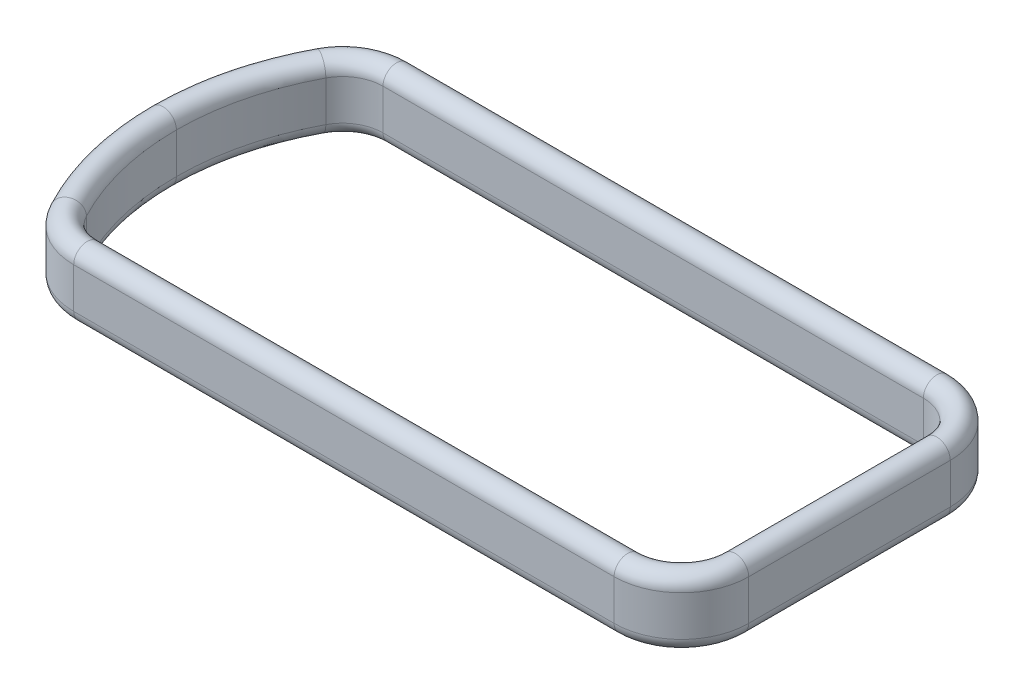
ISO-10303-21;
HEADER;
FILE_DESCRIPTION(('STEP AP214'),'2;1');
FILE_NAME('part.step','',(''),(''),'','','');
FILE_SCHEMA(('AUTOMOTIVE_DESIGN { 1 0 10303 214 1 1 1 1 }'));
ENDSEC;
DATA;
#1=APPLICATION_CONTEXT('core data for automotive mechanical design processes');
#2=APPLICATION_PROTOCOL_DEFINITION('international standard','automotive_design',2000,#1);
#3=PRODUCT_CONTEXT('',#1,'mechanical');
#4=PRODUCT('Part','Part','',(#3));
#5=PRODUCT_RELATED_PRODUCT_CATEGORY('part','',(#4));
#6=PRODUCT_DEFINITION_FORMATION('','',#4);
#7=PRODUCT_DEFINITION_CONTEXT('part definition',#1,'design');
#8=PRODUCT_DEFINITION('design','',#6,#7);
#9=PRODUCT_DEFINITION_SHAPE('','',#8);
#10=(LENGTH_UNIT() NAMED_UNIT(*) SI_UNIT(.MILLI.,.METRE.));
#11=(NAMED_UNIT(*) PLANE_ANGLE_UNIT() SI_UNIT($,.RADIAN.));
#12=(NAMED_UNIT(*) SI_UNIT($,.STERADIAN.) SOLID_ANGLE_UNIT());
#13=UNCERTAINTY_MEASURE_WITH_UNIT(LENGTH_MEASURE(1.E-05),#10,'distance_accuracy_value','');
#14=(GEOMETRIC_REPRESENTATION_CONTEXT(3) GLOBAL_UNCERTAINTY_ASSIGNED_CONTEXT((#13)) GLOBAL_UNIT_ASSIGNED_CONTEXT((#10,
#11,#12)) REPRESENTATION_CONTEXT('',''));
#15=CARTESIAN_POINT('',(0.,0.,0.));
#16=DIRECTION('',(0.,0.,1.));
#17=DIRECTION('',(1.,0.,0.));
#18=AXIS2_PLACEMENT_3D('',#15,#16,#17);
#19=CARTESIAN_POINT('',(-29.6489581699562,-15.,0.));
#20=DIRECTION('',(0.,1.,0.));
#21=DIRECTION('',(0.,0.,1.));
#22=AXIS2_PLACEMENT_3D('',#19,#20,#21);
#23=TOROIDAL_SURFACE('',#22,100.,5.00000000000006);
#24=CARTESIAN_POINT('',(-29.6489581699562,-15.,0.));
#25=DIRECTION('',(0.,1.,0.));
#26=DIRECTION('',(-0.883776045751095,0.,-0.467910141968048));
#27=AXIS2_PLACEMENT_3D('',#24,#25,#26);
#28=CIRCLE('',#27,105.);
#29=CARTESIAN_POINT('',(-122.445442973821,-15.,-49.1305649066451));
#30=VERTEX_POINT('',#29);
#31=CARTESIAN_POINT('',(-134.648958169956,-15.,0.));
#32=VERTEX_POINT('',#31);
#33=EDGE_CURVE('E11',#30,#32,#28,.T.);
#34=ORIENTED_EDGE('',*,*,#33,.F.);
#35=CARTESIAN_POINT('',(-118.026562745066,-15.,-46.7910141968048));
#36=DIRECTION('',(-0.467910141968049,0.,0.883776045751094));
#37=DIRECTION('',(0.883776045751094,0.,0.467910141968049));
#38=AXIS2_PLACEMENT_3D('',#35,#36,#37);
#39=CIRCLE('',#38,5.00000000000006);
#40=CARTESIAN_POINT('',(-113.60768251631,-15.,-44.4514634869646));
#41=VERTEX_POINT('',#40);
#42=EDGE_CURVE('E38',#30,#41,#39,.T.);
#43=ORIENTED_EDGE('',*,*,#42,.T.);
#44=CARTESIAN_POINT('',(-29.6489581699562,-15.,0.));
#45=DIRECTION('',(0.,1.,0.));
#46=DIRECTION('',(-0.883776045751095,0.,-0.467910141968048));
#47=AXIS2_PLACEMENT_3D('',#44,#45,#46);
#48=CIRCLE('',#47,95.);
#49=CARTESIAN_POINT('',(-124.648958169956,-15.,0.));
#50=VERTEX_POINT('',#49);
#51=EDGE_CURVE('E183',#41,#50,#48,.T.);
#52=ORIENTED_EDGE('',*,*,#51,.T.);
#53=CARTESIAN_POINT('',(-129.648958169956,-15.,0.));
#54=DIRECTION('',(0.,0.,1.));
#55=DIRECTION('',(1.,0.,0.));
#56=AXIS2_PLACEMENT_3D('',#53,#54,#55);
#57=CIRCLE('',#56,5.00000000000006);
#58=EDGE_CURVE('E186',#32,#50,#57,.T.);
#59=ORIENTED_EDGE('',*,*,#58,.F.);
#60=EDGE_LOOP('',(#34,#43,#52,#59));
#61=FACE_BOUND('',#60,.T.);
#62=ADVANCED_FACE('F35',(#61),#23,.T.);
#63=CARTESIAN_POINT('',(-29.6489581699562,0.,0.));
#64=DIRECTION('',(0.,1.,0.));
#65=DIRECTION('',(0.,0.,1.));
#66=AXIS2_PLACEMENT_3D('',#63,#64,#65);
#67=CYLINDRICAL_SURFACE('',#66,105.);
#68=CARTESIAN_POINT('',(-29.6489581699562,0.,0.));
#69=DIRECTION('',(0.,1.,0.));
#70=DIRECTION('',(-0.883776045751095,0.,-0.467910141968048));
#71=AXIS2_PLACEMENT_3D('',#68,#69,#70);
#72=CIRCLE('',#71,105.);
#73=CARTESIAN_POINT('',(-122.445442973821,0.,-49.1305649066451));
#74=VERTEX_POINT('',#73);
#75=CARTESIAN_POINT('',(-134.648958169956,0.,0.));
#76=VERTEX_POINT('',#75);
#77=EDGE_CURVE('E43',#74,#76,#72,.T.);
#78=ORIENTED_EDGE('',*,*,#77,.F.);
#79=DIRECTION('',(0.,-1.,0.));
#80=VECTOR('',#79,1.);
#81=CARTESIAN_POINT('',(-122.445442973821,0.,-49.130564906645));
#82=LINE('',#81,#80);
#83=EDGE_CURVE('E336',#74,#30,#82,.T.);
#84=ORIENTED_EDGE('',*,*,#83,.T.);
#85=ORIENTED_EDGE('',*,*,#33,.T.);
#86=DIRECTION('',(0.,-1.,0.));
#87=VECTOR('',#86,1.);
#88=CARTESIAN_POINT('',(-134.648958169956,0.,0.));
#89=LINE('',#88,#87);
#90=EDGE_CURVE('E211',#76,#32,#89,.T.);
#91=ORIENTED_EDGE('',*,*,#90,.F.);
#92=EDGE_LOOP('',(#78,#84,#85,#91));
#93=FACE_BOUND('',#92,.T.);
#94=ADVANCED_FACE('F458',(#93),#67,.T.);
#95=CARTESIAN_POINT('',(-29.6489581699562,0.,0.));
#96=DIRECTION('',(0.,1.,0.));
#97=DIRECTION('',(0.,0.,1.));
#98=AXIS2_PLACEMENT_3D('',#95,#96,#97);
#99=TOROIDAL_SURFACE('',#98,100.,5.00000000000001);
#100=CARTESIAN_POINT('',(-29.6489581699562,0.,0.));
#101=DIRECTION('',(0.,1.,0.));
#102=DIRECTION('',(-0.883776045751095,0.,-0.467910141968048));
#103=AXIS2_PLACEMENT_3D('',#100,#101,#102);
#104=CIRCLE('',#103,95.);
#105=CARTESIAN_POINT('',(-113.60768251631,0.,-44.4514634869646));
#106=VERTEX_POINT('',#105);
#107=CARTESIAN_POINT('',(-124.648958169956,0.,0.));
#108=VERTEX_POINT('',#107);
#109=EDGE_CURVE('E192',#106,#108,#104,.T.);
#110=ORIENTED_EDGE('',*,*,#109,.F.);
#111=CARTESIAN_POINT('',(-118.026562745066,0.,-46.7910141968048));
#112=DIRECTION('',(-0.467910141968049,0.,0.883776045751094));
#113=DIRECTION('',(0.883776045751094,0.,0.467910141968049));
#114=AXIS2_PLACEMENT_3D('',#111,#112,#113);
#115=CIRCLE('',#114,5.00000000000001);
#116=EDGE_CURVE('E292',#106,#74,#115,.T.);
#117=ORIENTED_EDGE('',*,*,#116,.T.);
#118=ORIENTED_EDGE('',*,*,#77,.T.);
#119=CARTESIAN_POINT('',(-129.648958169956,0.,0.));
#120=DIRECTION('',(0.,0.,1.));
#121=DIRECTION('',(1.,0.,0.));
#122=AXIS2_PLACEMENT_3D('',#119,#120,#121);
#123=CIRCLE('',#122,5.00000000000001);
#124=EDGE_CURVE('E215',#108,#76,#123,.T.);
#125=ORIENTED_EDGE('',*,*,#124,.F.);
#126=EDGE_LOOP('',(#110,#117,#118,#125));
#127=FACE_BOUND('',#126,.T.);
#128=ADVANCED_FACE('F462',(#127),#99,.T.);
#129=CARTESIAN_POINT('',(-100.351041830044,-15.,-37.4328113574438));
#130=DIRECTION('',(0.,1.,0.));
#131=DIRECTION('',(0.,0.,1.));
#132=AXIS2_PLACEMENT_3D('',#129,#130,#131);
#133=TOROIDAL_SURFACE('',#132,20.0000000000001,5.00000000000006);
#134=ORIENTED_EDGE('',*,*,#42,.F.);
#135=CARTESIAN_POINT('',(-100.351041830044,-15.,-37.4328113574438));
#136=DIRECTION('',(0.,1.,0.));
#137=DIRECTION('',(0.,0.,-1.));
#138=AXIS2_PLACEMENT_3D('',#135,#136,#137);
#139=CIRCLE('',#138,25.0000000000002);
#140=CARTESIAN_POINT('',(-100.351041830044,-15.,-62.432811357444));
#141=VERTEX_POINT('',#140);
#142=EDGE_CURVE('E104',#141,#30,#139,.T.);
#143=ORIENTED_EDGE('',*,*,#142,.F.);
#144=CARTESIAN_POINT('',(-100.351041830044,-15.,-57.4328113574439));
#145=DIRECTION('',(-1.,0.,0.));
#146=DIRECTION('',(0.,0.,1.));
#147=AXIS2_PLACEMENT_3D('',#144,#145,#146);
#148=CIRCLE('',#147,5.00000000000006);
#149=CARTESIAN_POINT('',(-100.351041830044,-15.,-52.4328113574438));
#150=VERTEX_POINT('',#149);
#151=EDGE_CURVE('E295',#141,#150,#148,.T.);
#152=ORIENTED_EDGE('',*,*,#151,.T.);
#153=CARTESIAN_POINT('',(-100.351041830044,-15.,-37.4328113574438));
#154=DIRECTION('',(0.,1.,0.));
#155=DIRECTION('',(0.,0.,-1.));
#156=AXIS2_PLACEMENT_3D('',#153,#154,#155);
#157=CIRCLE('',#156,15.);
#158=EDGE_CURVE('E290',#150,#41,#157,.T.);
#159=ORIENTED_EDGE('',*,*,#158,.T.);
#160=EDGE_LOOP('',(#134,#143,#152,#159));
#161=FACE_BOUND('',#160,.T.);
#162=ADVANCED_FACE('F382',(#161),#133,.T.);
#163=CARTESIAN_POINT('',(-100.351041830044,0.,-37.4328113574438));
#164=DIRECTION('',(0.,1.,0.));
#165=DIRECTION('',(0.,0.,1.));
#166=AXIS2_PLACEMENT_3D('',#163,#164,#165);
#167=CYLINDRICAL_SURFACE('',#166,25.0000000000001);
#168=ORIENTED_EDGE('',*,*,#142,.T.);
#169=ORIENTED_EDGE('',*,*,#83,.F.);
#170=CARTESIAN_POINT('',(-100.351041830044,0.,-37.4328113574438));
#171=DIRECTION('',(0.,1.,0.));
#172=DIRECTION('',(0.,0.,-1.));
#173=AXIS2_PLACEMENT_3D('',#170,#171,#172);
#174=CIRCLE('',#173,25.);
#175=CARTESIAN_POINT('',(-100.351041830044,0.,-62.4328113574438));
#176=VERTEX_POINT('',#175);
#177=EDGE_CURVE('E113',#176,#74,#174,.T.);
#178=ORIENTED_EDGE('',*,*,#177,.F.);
#179=DIRECTION('',(0.,-1.,0.));
#180=VECTOR('',#179,1.);
#181=CARTESIAN_POINT('',(-100.351041830044,0.,-62.4328113574438));
#182=LINE('',#181,#180);
#183=EDGE_CURVE('E332',#176,#141,#182,.T.);
#184=ORIENTED_EDGE('',*,*,#183,.T.);
#185=EDGE_LOOP('',(#168,#169,#178,#184));
#186=FACE_BOUND('',#185,.T.);
#187=ADVANCED_FACE('F459',(#186),#167,.T.);
#188=CARTESIAN_POINT('',(-100.351041830044,0.,-37.4328113574438));
#189=DIRECTION('',(0.,1.,0.));
#190=DIRECTION('',(0.,0.,1.));
#191=AXIS2_PLACEMENT_3D('',#188,#189,#190);
#192=TOROIDAL_SURFACE('',#191,20.,5.00000000000001);
#193=ORIENTED_EDGE('',*,*,#177,.T.);
#194=ORIENTED_EDGE('',*,*,#116,.F.);
#195=CARTESIAN_POINT('',(-100.351041830044,0.,-37.4328113574438));
#196=DIRECTION('',(0.,1.,0.));
#197=DIRECTION('',(0.,0.,-1.));
#198=AXIS2_PLACEMENT_3D('',#195,#196,#197);
#199=CIRCLE('',#198,15.);
#200=CARTESIAN_POINT('',(-100.351041830044,0.,-52.4328113574438));
#201=VERTEX_POINT('',#200);
#202=EDGE_CURVE('E121',#201,#106,#199,.T.);
#203=ORIENTED_EDGE('',*,*,#202,.F.);
#204=CARTESIAN_POINT('',(-100.351041830044,0.,-57.4328113574438));
#205=DIRECTION('',(-1.,0.,0.));
#206=DIRECTION('',(0.,0.,1.));
#207=AXIS2_PLACEMENT_3D('',#204,#205,#206);
#208=CIRCLE('',#207,5.00000000000001);
#209=EDGE_CURVE('E284',#201,#176,#208,.T.);
#210=ORIENTED_EDGE('',*,*,#209,.T.);
#211=EDGE_LOOP('',(#193,#194,#203,#210));
#212=FACE_BOUND('',#211,.T.);
#213=ADVANCED_FACE('F460',(#212),#192,.T.);
#214=CARTESIAN_POINT('',(-100.351041830044,0.,-37.4328113574438));
#215=DIRECTION('',(0.,1.,0.));
#216=DIRECTION('',(0.,0.,1.));
#217=AXIS2_PLACEMENT_3D('',#214,#215,#216);
#218=CYLINDRICAL_SURFACE('',#217,15.);
#219=ORIENTED_EDGE('',*,*,#202,.T.);
#220=DIRECTION('',(0.,1.,0.));
#221=VECTOR('',#220,1.);
#222=CARTESIAN_POINT('',(-113.60768251631,0.,-44.4514634869645));
#223=LINE('',#222,#221);
#224=EDGE_CURVE('E288',#41,#106,#223,.T.);
#225=ORIENTED_EDGE('',*,*,#224,.F.);
#226=ORIENTED_EDGE('',*,*,#158,.F.);
#227=DIRECTION('',(0.,1.,0.));
#228=VECTOR('',#227,1.);
#229=CARTESIAN_POINT('',(-100.351041830044,0.,-52.4328113574438));
#230=LINE('',#229,#228);
#231=EDGE_CURVE('E279',#150,#201,#230,.T.);
#232=ORIENTED_EDGE('',*,*,#231,.T.);
#233=EDGE_LOOP('',(#219,#225,#226,#232));
#234=FACE_BOUND('',#233,.T.);
#235=ADVANCED_FACE('F506',(#234),#218,.F.);
#236=CARTESIAN_POINT('',(100.351041830044,-15.,-57.4328113574439));
#237=DIRECTION('',(-1.,0.,0.));
#238=DIRECTION('',(0.,0.,1.));
#239=AXIS2_PLACEMENT_3D('',#236,#237,#238);
#240=CYLINDRICAL_SURFACE('',#239,5.00000000000006);
#241=ORIENTED_EDGE('',*,*,#151,.F.);
#242=DIRECTION('',(-1.,0.,0.));
#243=VECTOR('',#242,1.);
#244=CARTESIAN_POINT('',(100.351041830044,-15.,-62.432811357444));
#245=LINE('',#244,#243);
#246=CARTESIAN_POINT('',(100.351041830044,-15.,-62.432811357444));
#247=VERTEX_POINT('',#246);
#248=EDGE_CURVE('E365',#247,#141,#245,.T.);
#249=ORIENTED_EDGE('',*,*,#248,.F.);
#250=CARTESIAN_POINT('',(100.351041830044,-15.,-57.4328113574439));
#251=DIRECTION('',(-1.,0.,0.));
#252=DIRECTION('',(0.,0.,1.));
#253=AXIS2_PLACEMENT_3D('',#250,#251,#252);
#254=CIRCLE('',#253,5.00000000000006);
#255=CARTESIAN_POINT('',(100.351041830044,-15.,-52.4328113574438));
#256=VERTEX_POINT('',#255);
#257=EDGE_CURVE('E287',#247,#256,#254,.T.);
#258=ORIENTED_EDGE('',*,*,#257,.T.);
#259=DIRECTION('',(-1.,0.,0.));
#260=VECTOR('',#259,1.);
#261=CARTESIAN_POINT('',(100.351041830044,-15.,-52.4328113574438));
#262=LINE('',#261,#260);
#263=EDGE_CURVE('E282',#256,#150,#262,.T.);
#264=ORIENTED_EDGE('',*,*,#263,.T.);
#265=EDGE_LOOP('',(#241,#249,#258,#264));
#266=FACE_BOUND('',#265,.T.);
#267=ADVANCED_FACE('F387',(#266),#240,.T.);
#268=CARTESIAN_POINT('',(100.351041830044,0.,-62.4328113574439));
#269=DIRECTION('',(0.,0.,-1.));
#270=DIRECTION('',(0.,1.,0.));
#271=AXIS2_PLACEMENT_3D('',#268,#269,#270);
#272=PLANE('',#271);
#273=ORIENTED_EDGE('',*,*,#248,.T.);
#274=ORIENTED_EDGE('',*,*,#183,.F.);
#275=DIRECTION('',(-1.,0.,0.));
#276=VECTOR('',#275,1.);
#277=CARTESIAN_POINT('',(100.351041830044,0.,-62.4328113574439));
#278=LINE('',#277,#276);
#279=CARTESIAN_POINT('',(100.351041830044,0.,-62.4328113574438));
#280=VERTEX_POINT('',#279);
#281=EDGE_CURVE('E148',#280,#176,#278,.T.);
#282=ORIENTED_EDGE('',*,*,#281,.F.);
#283=DIRECTION('',(0.,-1.,0.));
#284=VECTOR('',#283,1.);
#285=CARTESIAN_POINT('',(100.351041830044,0.,-62.4328113574439));
#286=LINE('',#285,#284);
#287=EDGE_CURVE('E329',#280,#247,#286,.T.);
#288=ORIENTED_EDGE('',*,*,#287,.T.);
#289=EDGE_LOOP('',(#273,#274,#282,#288));
#290=FACE_BOUND('',#289,.T.);
#291=ADVANCED_FACE('F522',(#290),#272,.T.);
#292=CARTESIAN_POINT('',(100.351041830044,0.,-57.4328113574439));
#293=DIRECTION('',(-1.,0.,0.));
#294=DIRECTION('',(0.,0.,1.));
#295=AXIS2_PLACEMENT_3D('',#292,#293,#294);
#296=CYLINDRICAL_SURFACE('',#295,5.00000000000001);
#297=ORIENTED_EDGE('',*,*,#281,.T.);
#298=ORIENTED_EDGE('',*,*,#209,.F.);
#299=DIRECTION('',(-1.,0.,0.));
#300=VECTOR('',#299,1.);
#301=CARTESIAN_POINT('',(100.351041830044,0.,-52.4328113574438));
#302=LINE('',#301,#300);
#303=CARTESIAN_POINT('',(100.351041830044,0.,-52.4328113574438));
#304=VERTEX_POINT('',#303);
#305=EDGE_CURVE('E154',#304,#201,#302,.T.);
#306=ORIENTED_EDGE('',*,*,#305,.F.);
#307=CARTESIAN_POINT('',(100.351041830044,0.,-57.4328113574439));
#308=DIRECTION('',(-1.,0.,0.));
#309=DIRECTION('',(0.,0.,1.));
#310=AXIS2_PLACEMENT_3D('',#307,#308,#309);
#311=CIRCLE('',#310,5.00000000000001);
#312=EDGE_CURVE('E275',#304,#280,#311,.T.);
#313=ORIENTED_EDGE('',*,*,#312,.T.);
#314=EDGE_LOOP('',(#297,#298,#306,#313));
#315=FACE_BOUND('',#314,.T.);
#316=ADVANCED_FACE('F531',(#315),#296,.T.);
#317=CARTESIAN_POINT('',(100.351041830044,0.,-52.4328113574438));
#318=DIRECTION('',(0.,0.,1.));
#319=DIRECTION('',(0.,-1.,0.));
#320=AXIS2_PLACEMENT_3D('',#317,#318,#319);
#321=PLANE('',#320);
#322=ORIENTED_EDGE('',*,*,#305,.T.);
#323=ORIENTED_EDGE('',*,*,#231,.F.);
#324=ORIENTED_EDGE('',*,*,#263,.F.);
#325=DIRECTION('',(0.,1.,0.));
#326=VECTOR('',#325,1.);
#327=CARTESIAN_POINT('',(100.351041830044,0.,-52.4328113574438));
#328=LINE('',#327,#326);
#329=EDGE_CURVE('E268',#256,#304,#328,.T.);
#330=ORIENTED_EDGE('',*,*,#329,.T.);
#331=EDGE_LOOP('',(#322,#323,#324,#330));
#332=FACE_BOUND('',#331,.T.);
#333=ADVANCED_FACE('F385',(#332),#321,.T.);
#334=CARTESIAN_POINT('',(100.351041830044,-15.,-37.4328113574438));
#335=DIRECTION('',(0.,1.,0.));
#336=DIRECTION('',(0.,0.,1.));
#337=AXIS2_PLACEMENT_3D('',#334,#335,#336);
#338=TOROIDAL_SURFACE('',#337,20.0000000000001,5.00000000000006);
#339=ORIENTED_EDGE('',*,*,#257,.F.);
#340=CARTESIAN_POINT('',(100.351041830044,-15.,-37.4328113574438));
#341=DIRECTION('',(0.,1.,0.));
#342=DIRECTION('',(1.,0.,0.));
#343=AXIS2_PLACEMENT_3D('',#340,#341,#342);
#344=CIRCLE('',#343,25.0000000000002);
#345=CARTESIAN_POINT('',(125.351041830044,-15.,-37.4328113574438));
#346=VERTEX_POINT('',#345);
#347=EDGE_CURVE('E361',#346,#247,#344,.T.);
#348=ORIENTED_EDGE('',*,*,#347,.F.);
#349=CARTESIAN_POINT('',(120.351041830044,-15.,-37.4328113574438));
#350=DIRECTION('',(0.,0.,-1.));
#351=DIRECTION('',(-1.,0.,0.));
#352=AXIS2_PLACEMENT_3D('',#349,#350,#351);
#353=CIRCLE('',#352,5.00000000000006);
#354=CARTESIAN_POINT('',(115.351041830044,-15.,-37.4328113574438));
#355=VERTEX_POINT('',#354);
#356=EDGE_CURVE('E278',#346,#355,#353,.T.);
#357=ORIENTED_EDGE('',*,*,#356,.T.);
#358=CARTESIAN_POINT('',(100.351041830044,-15.,-37.4328113574438));
#359=DIRECTION('',(0.,1.,0.));
#360=DIRECTION('',(1.,0.,0.));
#361=AXIS2_PLACEMENT_3D('',#358,#359,#360);
#362=CIRCLE('',#361,15.);
#363=EDGE_CURVE('E272',#355,#256,#362,.T.);
#364=ORIENTED_EDGE('',*,*,#363,.T.);
#365=EDGE_LOOP('',(#339,#348,#357,#364));
#366=FACE_BOUND('',#365,.T.);
#367=ADVANCED_FACE('F396',(#366),#338,.T.);
#368=CARTESIAN_POINT('',(100.351041830044,0.,-37.4328113574438));
#369=DIRECTION('',(0.,1.,0.));
#370=DIRECTION('',(0.,0.,1.));
#371=AXIS2_PLACEMENT_3D('',#368,#369,#370);
#372=CYLINDRICAL_SURFACE('',#371,25.0000000000001);
#373=ORIENTED_EDGE('',*,*,#347,.T.);
#374=ORIENTED_EDGE('',*,*,#287,.F.);
#375=CARTESIAN_POINT('',(100.351041830044,0.,-37.4328113574438));
#376=DIRECTION('',(0.,1.,0.));
#377=DIRECTION('',(1.,0.,0.));
#378=AXIS2_PLACEMENT_3D('',#375,#376,#377);
#379=CIRCLE('',#378,25.);
#380=CARTESIAN_POINT('',(125.351041830044,0.,-37.4328113574438));
#381=VERTEX_POINT('',#380);
#382=EDGE_CURVE('E326',#381,#280,#379,.T.);
#383=ORIENTED_EDGE('',*,*,#382,.F.);
#384=DIRECTION('',(0.,-1.,0.));
#385=VECTOR('',#384,1.);
#386=CARTESIAN_POINT('',(125.351041830044,0.,-37.4328113574438));
#387=LINE('',#386,#385);
#388=EDGE_CURVE('E323',#381,#346,#387,.T.);
#389=ORIENTED_EDGE('',*,*,#388,.T.);
#390=EDGE_LOOP('',(#373,#374,#383,#389));
#391=FACE_BOUND('',#390,.T.);
#392=ADVANCED_FACE('F414',(#391),#372,.T.);
#393=CARTESIAN_POINT('',(100.351041830044,0.,-37.4328113574438));
#394=DIRECTION('',(0.,1.,0.));
#395=DIRECTION('',(0.,0.,1.));
#396=AXIS2_PLACEMENT_3D('',#393,#394,#395);
#397=TOROIDAL_SURFACE('',#396,20.,5.00000000000001);
#398=ORIENTED_EDGE('',*,*,#382,.T.);
#399=ORIENTED_EDGE('',*,*,#312,.F.);
#400=CARTESIAN_POINT('',(100.351041830044,0.,-37.4328113574438));
#401=DIRECTION('',(0.,1.,0.));
#402=DIRECTION('',(1.,0.,0.));
#403=AXIS2_PLACEMENT_3D('',#400,#401,#402);
#404=CIRCLE('',#403,15.);
#405=CARTESIAN_POINT('',(115.351041830044,0.,-37.4328113574438));
#406=VERTEX_POINT('',#405);
#407=EDGE_CURVE('E271',#406,#304,#404,.T.);
#408=ORIENTED_EDGE('',*,*,#407,.F.);
#409=CARTESIAN_POINT('',(120.351041830044,0.,-37.4328113574438));
#410=DIRECTION('',(0.,0.,-1.));
#411=DIRECTION('',(-1.,0.,0.));
#412=AXIS2_PLACEMENT_3D('',#409,#410,#411);
#413=CIRCLE('',#412,5.00000000000001);
#414=EDGE_CURVE('E260',#406,#381,#413,.T.);
#415=ORIENTED_EDGE('',*,*,#414,.T.);
#416=EDGE_LOOP('',(#398,#399,#408,#415));
#417=FACE_BOUND('',#416,.T.);
#418=ADVANCED_FACE('F407',(#417),#397,.T.);
#419=CARTESIAN_POINT('',(100.351041830044,0.,-37.4328113574438));
#420=DIRECTION('',(0.,1.,0.));
#421=DIRECTION('',(0.,0.,1.));
#422=AXIS2_PLACEMENT_3D('',#419,#420,#421);
#423=CYLINDRICAL_SURFACE('',#422,15.);
#424=ORIENTED_EDGE('',*,*,#407,.T.);
#425=ORIENTED_EDGE('',*,*,#329,.F.);
#426=ORIENTED_EDGE('',*,*,#363,.F.);
#427=DIRECTION('',(0.,1.,0.));
#428=VECTOR('',#427,1.);
#429=CARTESIAN_POINT('',(115.351041830044,0.,-37.4328113574438));
#430=LINE('',#429,#428);
#431=EDGE_CURVE('E257',#355,#406,#430,.T.);
#432=ORIENTED_EDGE('',*,*,#431,.T.);
#433=EDGE_LOOP('',(#424,#425,#426,#432));
#434=FACE_BOUND('',#433,.T.);
#435=ADVANCED_FACE('F394',(#434),#423,.F.);
#436=CARTESIAN_POINT('',(120.351041830044,-15.,37.4328113574438));
#437=DIRECTION('',(0.,0.,-1.));
#438=DIRECTION('',(-1.,0.,0.));
#439=AXIS2_PLACEMENT_3D('',#436,#437,#438);
#440=CYLINDRICAL_SURFACE('',#439,5.00000000000006);
#441=ORIENTED_EDGE('',*,*,#356,.F.);
#442=DIRECTION('',(0.,0.,-1.));
#443=VECTOR('',#442,1.);
#444=CARTESIAN_POINT('',(125.351041830044,-15.,37.4328113574438));
#445=LINE('',#444,#443);
#446=CARTESIAN_POINT('',(125.351041830044,-15.,37.4328113574438));
#447=VERTEX_POINT('',#446);
#448=EDGE_CURVE('E261',#447,#346,#445,.T.);
#449=ORIENTED_EDGE('',*,*,#448,.F.);
#450=CARTESIAN_POINT('',(120.351041830044,-15.,37.4328113574438));
#451=DIRECTION('',(0.,0.,-1.));
#452=DIRECTION('',(-1.,0.,0.));
#453=AXIS2_PLACEMENT_3D('',#450,#451,#452);
#454=CIRCLE('',#453,5.00000000000006);
#455=CARTESIAN_POINT('',(115.351041830044,-15.,37.4328113574438));
#456=VERTEX_POINT('',#455);
#457=EDGE_CURVE('E267',#447,#456,#454,.T.);
#458=ORIENTED_EDGE('',*,*,#457,.T.);
#459=DIRECTION('',(0.,0.,-1.));
#460=VECTOR('',#459,1.);
#461=CARTESIAN_POINT('',(115.351041830044,-15.,37.4328113574438));
#462=LINE('',#461,#460);
#463=EDGE_CURVE('E265',#456,#355,#462,.T.);
#464=ORIENTED_EDGE('',*,*,#463,.T.);
#465=EDGE_LOOP('',(#441,#449,#458,#464));
#466=FACE_BOUND('',#465,.T.);
#467=ADVANCED_FACE('F417',(#466),#440,.T.);
#468=CARTESIAN_POINT('',(125.351041830044,0.,37.4328113574438));
#469=DIRECTION('',(1.,0.,0.));
#470=DIRECTION('',(0.,1.,0.));
#471=AXIS2_PLACEMENT_3D('',#468,#469,#470);
#472=PLANE('',#471);
#473=ORIENTED_EDGE('',*,*,#448,.T.);
#474=ORIENTED_EDGE('',*,*,#388,.F.);
#475=DIRECTION('',(0.,0.,-1.));
#476=VECTOR('',#475,1.);
#477=CARTESIAN_POINT('',(125.351041830044,0.,37.4328113574438));
#478=LINE('',#477,#476);
#479=CARTESIAN_POINT('',(125.351041830044,0.,37.4328113574438));
#480=VERTEX_POINT('',#479);
#481=EDGE_CURVE('E264',#480,#381,#478,.T.);
#482=ORIENTED_EDGE('',*,*,#481,.F.);
#483=DIRECTION('',(0.,-1.,0.));
#484=VECTOR('',#483,1.);
#485=CARTESIAN_POINT('',(125.351041830044,0.,37.4328113574438));
#486=LINE('',#485,#484);
#487=EDGE_CURVE('E320',#480,#447,#486,.T.);
#488=ORIENTED_EDGE('',*,*,#487,.T.);
#489=EDGE_LOOP('',(#473,#474,#482,#488));
#490=FACE_BOUND('',#489,.T.);
#491=ADVANCED_FACE('F415',(#490),#472,.T.);
#492=CARTESIAN_POINT('',(120.351041830044,0.,37.4328113574438));
#493=DIRECTION('',(0.,0.,-1.));
#494=DIRECTION('',(-1.,0.,0.));
#495=AXIS2_PLACEMENT_3D('',#492,#493,#494);
#496=CYLINDRICAL_SURFACE('',#495,5.00000000000001);
#497=ORIENTED_EDGE('',*,*,#481,.T.);
#498=ORIENTED_EDGE('',*,*,#414,.F.);
#499=DIRECTION('',(0.,0.,-1.));
#500=VECTOR('',#499,1.);
#501=CARTESIAN_POINT('',(115.351041830044,0.,37.4328113574438));
#502=LINE('',#501,#500);
#503=CARTESIAN_POINT('',(115.351041830044,0.,37.4328113574438));
#504=VERTEX_POINT('',#503);
#505=EDGE_CURVE('E262',#504,#406,#502,.T.);
#506=ORIENTED_EDGE('',*,*,#505,.F.);
#507=CARTESIAN_POINT('',(120.351041830044,0.,37.4328113574438));
#508=DIRECTION('',(0.,0.,-1.));
#509=DIRECTION('',(-1.,0.,0.));
#510=AXIS2_PLACEMENT_3D('',#507,#508,#509);
#511=CIRCLE('',#510,5.00000000000001);
#512=EDGE_CURVE('E253',#504,#480,#511,.T.);
#513=ORIENTED_EDGE('',*,*,#512,.T.);
#514=EDGE_LOOP('',(#497,#498,#506,#513));
#515=FACE_BOUND('',#514,.T.);
#516=ADVANCED_FACE('F408',(#515),#496,.T.);
#517=CARTESIAN_POINT('',(115.351041830044,0.,37.4328113574438));
#518=DIRECTION('',(-1.,0.,0.));
#519=DIRECTION('',(0.,-1.,0.));
#520=AXIS2_PLACEMENT_3D('',#517,#518,#519);
#521=PLANE('',#520);
#522=ORIENTED_EDGE('',*,*,#505,.T.);
#523=ORIENTED_EDGE('',*,*,#431,.F.);
#524=ORIENTED_EDGE('',*,*,#463,.F.);
#525=DIRECTION('',(0.,1.,0.));
#526=VECTOR('',#525,1.);
#527=CARTESIAN_POINT('',(115.351041830044,0.,37.4328113574438));
#528=LINE('',#527,#526);
#529=EDGE_CURVE('E246',#456,#504,#528,.T.);
#530=ORIENTED_EDGE('',*,*,#529,.T.);
#531=EDGE_LOOP('',(#522,#523,#524,#530));
#532=FACE_BOUND('',#531,.T.);
#533=ADVANCED_FACE('F401',(#532),#521,.T.);
#534=CARTESIAN_POINT('',(100.351041830044,-15.,37.4328113574438));
#535=DIRECTION('',(0.,1.,0.));
#536=DIRECTION('',(0.,0.,1.));
#537=AXIS2_PLACEMENT_3D('',#534,#535,#536);
#538=TOROIDAL_SURFACE('',#537,20.0000000000001,5.00000000000006);
#539=ORIENTED_EDGE('',*,*,#457,.F.);
#540=CARTESIAN_POINT('',(100.351041830044,-15.,37.4328113574438));
#541=DIRECTION('',(0.,1.,0.));
#542=DIRECTION('',(0.,0.,1.));
#543=AXIS2_PLACEMENT_3D('',#540,#541,#542);
#544=CIRCLE('',#543,25.0000000000002);
#545=CARTESIAN_POINT('',(100.351041830044,-15.,62.432811357444));
#546=VERTEX_POINT('',#545);
#547=EDGE_CURVE('E354',#546,#447,#544,.T.);
#548=ORIENTED_EDGE('',*,*,#547,.F.);
#549=CARTESIAN_POINT('',(100.351041830044,-15.,57.4328113574439));
#550=DIRECTION('',(1.,0.,0.));
#551=DIRECTION('',(0.,0.,-1.));
#552=AXIS2_PLACEMENT_3D('',#549,#550,#551);
#553=CIRCLE('',#552,5.00000000000006);
#554=CARTESIAN_POINT('',(100.351041830044,-15.,52.4328113574438));
#555=VERTEX_POINT('',#554);
#556=EDGE_CURVE('E256',#546,#555,#553,.T.);
#557=ORIENTED_EDGE('',*,*,#556,.T.);
#558=CARTESIAN_POINT('',(100.351041830044,-15.,37.4328113574438));
#559=DIRECTION('',(0.,1.,0.));
#560=DIRECTION('',(0.,0.,1.));
#561=AXIS2_PLACEMENT_3D('',#558,#559,#560);
#562=CIRCLE('',#561,15.);
#563=EDGE_CURVE('E250',#555,#456,#562,.T.);
#564=ORIENTED_EDGE('',*,*,#563,.T.);
#565=EDGE_LOOP('',(#539,#548,#557,#564));
#566=FACE_BOUND('',#565,.T.);
#567=ADVANCED_FACE('F419',(#566),#538,.T.);
#568=CARTESIAN_POINT('',(100.351041830044,0.,37.4328113574438));
#569=DIRECTION('',(0.,1.,0.));
#570=DIRECTION('',(0.,0.,1.));
#571=AXIS2_PLACEMENT_3D('',#568,#569,#570);
#572=CYLINDRICAL_SURFACE('',#571,25.0000000000001);
#573=ORIENTED_EDGE('',*,*,#547,.T.);
#574=ORIENTED_EDGE('',*,*,#487,.F.);
#575=CARTESIAN_POINT('',(100.351041830044,0.,37.4328113574438));
#576=DIRECTION('',(0.,1.,0.));
#577=DIRECTION('',(0.,0.,1.));
#578=AXIS2_PLACEMENT_3D('',#575,#576,#577);
#579=CIRCLE('',#578,25.);
#580=CARTESIAN_POINT('',(100.351041830044,0.,62.4328113574439));
#581=VERTEX_POINT('',#580);
#582=EDGE_CURVE('E317',#581,#480,#579,.T.);
#583=ORIENTED_EDGE('',*,*,#582,.F.);
#584=DIRECTION('',(0.,-1.,0.));
#585=VECTOR('',#584,1.);
#586=CARTESIAN_POINT('',(100.351041830044,0.,62.4328113574439));
#587=LINE('',#586,#585);
#588=EDGE_CURVE('E314',#581,#546,#587,.T.);
#589=ORIENTED_EDGE('',*,*,#588,.T.);
#590=EDGE_LOOP('',(#573,#574,#583,#589));
#591=FACE_BOUND('',#590,.T.);
#592=ADVANCED_FACE('F422',(#591),#572,.T.);
#593=CARTESIAN_POINT('',(100.351041830044,0.,37.4328113574438));
#594=DIRECTION('',(0.,1.,0.));
#595=DIRECTION('',(0.,0.,1.));
#596=AXIS2_PLACEMENT_3D('',#593,#594,#595);
#597=TOROIDAL_SURFACE('',#596,20.,5.00000000000001);
#598=ORIENTED_EDGE('',*,*,#582,.T.);
#599=ORIENTED_EDGE('',*,*,#512,.F.);
#600=CARTESIAN_POINT('',(100.351041830044,0.,37.4328113574438));
#601=DIRECTION('',(0.,1.,0.));
#602=DIRECTION('',(0.,0.,1.));
#603=AXIS2_PLACEMENT_3D('',#600,#601,#602);
#604=CIRCLE('',#603,15.);
#605=CARTESIAN_POINT('',(100.351041830044,0.,52.4328113574438));
#606=VERTEX_POINT('',#605);
#607=EDGE_CURVE('E249',#606,#504,#604,.T.);
#608=ORIENTED_EDGE('',*,*,#607,.F.);
#609=CARTESIAN_POINT('',(100.351041830044,0.,57.4328113574439));
#610=DIRECTION('',(1.,0.,0.));
#611=DIRECTION('',(0.,0.,-1.));
#612=AXIS2_PLACEMENT_3D('',#609,#610,#611);
#613=CIRCLE('',#612,5.00000000000001);
#614=EDGE_CURVE('E242',#606,#581,#613,.T.);
#615=ORIENTED_EDGE('',*,*,#614,.T.);
#616=EDGE_LOOP('',(#598,#599,#608,#615));
#617=FACE_BOUND('',#616,.T.);
#618=ADVANCED_FACE('F432',(#617),#597,.T.);
#619=CARTESIAN_POINT('',(100.351041830044,0.,37.4328113574438));
#620=DIRECTION('',(0.,1.,0.));
#621=DIRECTION('',(0.,0.,1.));
#622=AXIS2_PLACEMENT_3D('',#619,#620,#621);
#623=CYLINDRICAL_SURFACE('',#622,15.);
#624=ORIENTED_EDGE('',*,*,#607,.T.);
#625=ORIENTED_EDGE('',*,*,#529,.F.);
#626=ORIENTED_EDGE('',*,*,#563,.F.);
#627=DIRECTION('',(0.,1.,0.));
#628=VECTOR('',#627,1.);
#629=CARTESIAN_POINT('',(100.351041830044,0.,52.4328113574438));
#630=LINE('',#629,#628);
#631=EDGE_CURVE('E235',#555,#606,#630,.T.);
#632=ORIENTED_EDGE('',*,*,#631,.T.);
#633=EDGE_LOOP('',(#624,#625,#626,#632));
#634=FACE_BOUND('',#633,.T.);
#635=ADVANCED_FACE('F434',(#634),#623,.F.);
#636=CARTESIAN_POINT('',(-100.351041830044,-15.,57.4328113574439));
#637=DIRECTION('',(1.,0.,0.));
#638=DIRECTION('',(0.,0.,-1.));
#639=AXIS2_PLACEMENT_3D('',#636,#637,#638);
#640=CYLINDRICAL_SURFACE('',#639,5.00000000000006);
#641=ORIENTED_EDGE('',*,*,#556,.F.);
#642=DIRECTION('',(1.,0.,0.));
#643=VECTOR('',#642,1.);
#644=CARTESIAN_POINT('',(-100.351041830044,-15.,62.432811357444));
#645=LINE('',#644,#643);
#646=CARTESIAN_POINT('',(-100.351041830044,-15.,62.432811357444));
#647=VERTEX_POINT('',#646);
#648=EDGE_CURVE('E349',#647,#546,#645,.T.);
#649=ORIENTED_EDGE('',*,*,#648,.F.);
#650=CARTESIAN_POINT('',(-100.351041830044,-15.,57.4328113574439));
#651=DIRECTION('',(1.,0.,0.));
#652=DIRECTION('',(0.,0.,-1.));
#653=AXIS2_PLACEMENT_3D('',#650,#651,#652);
#654=CIRCLE('',#653,5.00000000000006);
#655=CARTESIAN_POINT('',(-100.351041830044,-15.,52.4328113574438));
#656=VERTEX_POINT('',#655);
#657=EDGE_CURVE('E245',#647,#656,#654,.T.);
#658=ORIENTED_EDGE('',*,*,#657,.T.);
#659=DIRECTION('',(1.,0.,0.));
#660=VECTOR('',#659,1.);
#661=CARTESIAN_POINT('',(-100.351041830044,-15.,52.4328113574438));
#662=LINE('',#661,#660);
#663=EDGE_CURVE('E239',#656,#555,#662,.T.);
#664=ORIENTED_EDGE('',*,*,#663,.T.);
#665=EDGE_LOOP('',(#641,#649,#658,#664));
#666=FACE_BOUND('',#665,.T.);
#667=ADVANCED_FACE('F439',(#666),#640,.T.);
#668=CARTESIAN_POINT('',(-100.351041830044,0.,62.4328113574438));
#669=DIRECTION('',(0.,0.,1.));
#670=DIRECTION('',(0.,-1.,0.));
#671=AXIS2_PLACEMENT_3D('',#668,#669,#670);
#672=PLANE('',#671);
#673=ORIENTED_EDGE('',*,*,#648,.T.);
#674=ORIENTED_EDGE('',*,*,#588,.F.);
#675=DIRECTION('',(1.,0.,0.));
#676=VECTOR('',#675,1.);
#677=CARTESIAN_POINT('',(-100.351041830044,0.,62.4328113574438));
#678=LINE('',#677,#676);
#679=CARTESIAN_POINT('',(-100.351041830044,0.,62.4328113574438));
#680=VERTEX_POINT('',#679);
#681=EDGE_CURVE('E311',#680,#581,#678,.T.);
#682=ORIENTED_EDGE('',*,*,#681,.F.);
#683=DIRECTION('',(0.,-1.,0.));
#684=VECTOR('',#683,1.);
#685=CARTESIAN_POINT('',(-100.351041830044,0.,62.4328113574438));
#686=LINE('',#685,#684);
#687=EDGE_CURVE('E308',#680,#647,#686,.T.);
#688=ORIENTED_EDGE('',*,*,#687,.T.);
#689=EDGE_LOOP('',(#673,#674,#682,#688));
#690=FACE_BOUND('',#689,.T.);
#691=ADVANCED_FACE('F425',(#690),#672,.T.);
#692=CARTESIAN_POINT('',(-100.351041830044,0.,57.4328113574438));
#693=DIRECTION('',(1.,0.,0.));
#694=DIRECTION('',(0.,0.,-1.));
#695=AXIS2_PLACEMENT_3D('',#692,#693,#694);
#696=CYLINDRICAL_SURFACE('',#695,5.00000000000001);
#697=ORIENTED_EDGE('',*,*,#681,.T.);
#698=ORIENTED_EDGE('',*,*,#614,.F.);
#699=DIRECTION('',(1.,0.,0.));
#700=VECTOR('',#699,1.);
#701=CARTESIAN_POINT('',(-100.351041830044,0.,52.4328113574438));
#702=LINE('',#701,#700);
#703=CARTESIAN_POINT('',(-100.351041830044,0.,52.4328113574438));
#704=VERTEX_POINT('',#703);
#705=EDGE_CURVE('E238',#704,#606,#702,.T.);
#706=ORIENTED_EDGE('',*,*,#705,.F.);
#707=CARTESIAN_POINT('',(-100.351041830044,0.,57.4328113574438));
#708=DIRECTION('',(1.,0.,0.));
#709=DIRECTION('',(0.,0.,-1.));
#710=AXIS2_PLACEMENT_3D('',#707,#708,#709);
#711=CIRCLE('',#710,5.00000000000001);
#712=EDGE_CURVE('E231',#704,#680,#711,.T.);
#713=ORIENTED_EDGE('',*,*,#712,.T.);
#714=EDGE_LOOP('',(#697,#698,#706,#713));
#715=FACE_BOUND('',#714,.T.);
#716=ADVANCED_FACE('F429',(#715),#696,.T.);
#717=CARTESIAN_POINT('',(-100.351041830044,0.,52.4328113574438));
#718=DIRECTION('',(0.,0.,-1.));
#719=DIRECTION('',(0.,1.,0.));
#720=AXIS2_PLACEMENT_3D('',#717,#718,#719);
#721=PLANE('',#720);
#722=ORIENTED_EDGE('',*,*,#705,.T.);
#723=ORIENTED_EDGE('',*,*,#631,.F.);
#724=ORIENTED_EDGE('',*,*,#663,.F.);
#725=DIRECTION('',(0.,1.,0.));
#726=VECTOR('',#725,1.);
#727=CARTESIAN_POINT('',(-100.351041830044,0.,52.4328113574438));
#728=LINE('',#727,#726);
#729=EDGE_CURVE('E224',#656,#704,#728,.T.);
#730=ORIENTED_EDGE('',*,*,#729,.T.);
#731=EDGE_LOOP('',(#722,#723,#724,#730));
#732=FACE_BOUND('',#731,.T.);
#733=ADVANCED_FACE('F437',(#732),#721,.T.);
#734=CARTESIAN_POINT('',(-100.351041830044,-15.,37.4328113574438));
#735=DIRECTION('',(0.,1.,0.));
#736=DIRECTION('',(0.,0.,1.));
#737=AXIS2_PLACEMENT_3D('',#734,#735,#736);
#738=TOROIDAL_SURFACE('',#737,20.0000000000001,5.00000000000006);
#739=ORIENTED_EDGE('',*,*,#657,.F.);
#740=CARTESIAN_POINT('',(-100.351041830044,-15.,37.4328113574438));
#741=DIRECTION('',(0.,1.,0.));
#742=DIRECTION('',(-0.883776045751096,0.,0.467910141968046));
#743=AXIS2_PLACEMENT_3D('',#740,#741,#742);
#744=CIRCLE('',#743,25.0000000000002);
#745=CARTESIAN_POINT('',(-122.445442973821,-15.,49.1305649066451));
#746=VERTEX_POINT('',#745);
#747=EDGE_CURVE('E344',#746,#647,#744,.T.);
#748=ORIENTED_EDGE('',*,*,#747,.F.);
#749=CARTESIAN_POINT('',(-118.026562745066,-15.,46.7910141968048));
#750=DIRECTION('',(0.467910141968047,0.,0.883776045751095));
#751=DIRECTION('',(0.883776045751095,0.,-0.467910141968048));
#752=AXIS2_PLACEMENT_3D('',#749,#750,#751);
#753=CIRCLE('',#752,5.00000000000006);
#754=CARTESIAN_POINT('',(-113.60768251631,-15.,44.4514634869645));
#755=VERTEX_POINT('',#754);
#756=EDGE_CURVE('E234',#746,#755,#753,.T.);
#757=ORIENTED_EDGE('',*,*,#756,.T.);
#758=CARTESIAN_POINT('',(-100.351041830044,-15.,37.4328113574438));
#759=DIRECTION('',(0.,1.,0.));
#760=DIRECTION('',(-0.883776045751096,0.,0.467910141968046));
#761=AXIS2_PLACEMENT_3D('',#758,#759,#760);
#762=CIRCLE('',#761,15.);
#763=EDGE_CURVE('E228',#755,#656,#762,.T.);
#764=ORIENTED_EDGE('',*,*,#763,.T.);
#765=EDGE_LOOP('',(#739,#748,#757,#764));
#766=FACE_BOUND('',#765,.T.);
#767=ADVANCED_FACE('F445',(#766),#738,.T.);
#768=CARTESIAN_POINT('',(-100.351041830044,0.,37.4328113574438));
#769=DIRECTION('',(0.,1.,0.));
#770=DIRECTION('',(0.,0.,1.));
#771=AXIS2_PLACEMENT_3D('',#768,#769,#770);
#772=CYLINDRICAL_SURFACE('',#771,25.0000000000001);
#773=ORIENTED_EDGE('',*,*,#747,.T.);
#774=ORIENTED_EDGE('',*,*,#687,.F.);
#775=CARTESIAN_POINT('',(-100.351041830044,0.,37.4328113574438));
#776=DIRECTION('',(0.,1.,0.));
#777=DIRECTION('',(-0.883776045751096,0.,0.467910141968046));
#778=AXIS2_PLACEMENT_3D('',#775,#776,#777);
#779=CIRCLE('',#778,25.);
#780=CARTESIAN_POINT('',(-122.445442973821,0.,49.130564906645));
#781=VERTEX_POINT('',#780);
#782=EDGE_CURVE('E305',#781,#680,#779,.T.);
#783=ORIENTED_EDGE('',*,*,#782,.F.);
#784=DIRECTION('',(0.,-1.,0.));
#785=VECTOR('',#784,1.);
#786=CARTESIAN_POINT('',(-122.445442973821,0.,49.130564906645));
#787=LINE('',#786,#785);
#788=EDGE_CURVE('E302',#781,#746,#787,.T.);
#789=ORIENTED_EDGE('',*,*,#788,.T.);
#790=EDGE_LOOP('',(#773,#774,#783,#789));
#791=FACE_BOUND('',#790,.T.);
#792=ADVANCED_FACE('F451',(#791),#772,.T.);
#793=CARTESIAN_POINT('',(-100.351041830044,0.,37.4328113574438));
#794=DIRECTION('',(0.,1.,0.));
#795=DIRECTION('',(0.,0.,1.));
#796=AXIS2_PLACEMENT_3D('',#793,#794,#795);
#797=TOROIDAL_SURFACE('',#796,20.,5.00000000000001);
#798=ORIENTED_EDGE('',*,*,#782,.T.);
#799=ORIENTED_EDGE('',*,*,#712,.F.);
#800=CARTESIAN_POINT('',(-100.351041830044,0.,37.4328113574438));
#801=DIRECTION('',(0.,1.,0.));
#802=DIRECTION('',(-0.883776045751096,0.,0.467910141968046));
#803=AXIS2_PLACEMENT_3D('',#800,#801,#802);
#804=CIRCLE('',#803,15.);
#805=CARTESIAN_POINT('',(-113.60768251631,0.,44.4514634869645));
#806=VERTEX_POINT('',#805);
#807=EDGE_CURVE('E227',#806,#704,#804,.T.);
#808=ORIENTED_EDGE('',*,*,#807,.F.);
#809=CARTESIAN_POINT('',(-118.026562745066,0.,46.7910141968047));
#810=DIRECTION('',(0.467910141968047,0.,0.883776045751095));
#811=DIRECTION('',(0.883776045751095,0.,-0.467910141968048));
#812=AXIS2_PLACEMENT_3D('',#809,#810,#811);
#813=CIRCLE('',#812,5.00000000000001);
#814=EDGE_CURVE('E222',#806,#781,#813,.T.);
#815=ORIENTED_EDGE('',*,*,#814,.T.);
#816=EDGE_LOOP('',(#798,#799,#808,#815));
#817=FACE_BOUND('',#816,.T.);
#818=ADVANCED_FACE('F453',(#817),#797,.T.);
#819=CARTESIAN_POINT('',(-100.351041830044,0.,37.4328113574438));
#820=DIRECTION('',(0.,1.,0.));
#821=DIRECTION('',(0.,0.,1.));
#822=AXIS2_PLACEMENT_3D('',#819,#820,#821);
#823=CYLINDRICAL_SURFACE('',#822,15.);
#824=ORIENTED_EDGE('',*,*,#807,.T.);
#825=ORIENTED_EDGE('',*,*,#729,.F.);
#826=ORIENTED_EDGE('',*,*,#763,.F.);
#827=DIRECTION('',(0.,1.,0.));
#828=VECTOR('',#827,1.);
#829=CARTESIAN_POINT('',(-113.60768251631,0.,44.4514634869645));
#830=LINE('',#829,#828);
#831=EDGE_CURVE('E203',#755,#806,#830,.T.);
#832=ORIENTED_EDGE('',*,*,#831,.T.);
#833=EDGE_LOOP('',(#824,#825,#826,#832));
#834=FACE_BOUND('',#833,.T.);
#835=ADVANCED_FACE('F444',(#834),#823,.F.);
#836=CARTESIAN_POINT('',(-29.6489581699562,-15.,0.));
#837=DIRECTION('',(0.,1.,0.));
#838=DIRECTION('',(0.,0.,1.));
#839=AXIS2_PLACEMENT_3D('',#836,#837,#838);
#840=TOROIDAL_SURFACE('',#839,100.,5.00000000000006);
#841=ORIENTED_EDGE('',*,*,#756,.F.);
#842=CARTESIAN_POINT('',(-29.6489581699562,-15.,0.));
#843=DIRECTION('',(0.,1.,0.));
#844=DIRECTION('',(-1.,0.,0.));
#845=AXIS2_PLACEMENT_3D('',#842,#843,#844);
#846=CIRCLE('',#845,105.);
#847=EDGE_CURVE('E210',#32,#746,#846,.T.);
#848=ORIENTED_EDGE('',*,*,#847,.F.);
#849=ORIENTED_EDGE('',*,*,#58,.T.);
#850=CARTESIAN_POINT('',(-29.6489581699562,-15.,0.));
#851=DIRECTION('',(0.,1.,0.));
#852=DIRECTION('',(-1.,0.,0.));
#853=AXIS2_PLACEMENT_3D('',#850,#851,#852);
#854=CIRCLE('',#853,95.);
#855=EDGE_CURVE('E198',#50,#755,#854,.T.);
#856=ORIENTED_EDGE('',*,*,#855,.T.);
#857=EDGE_LOOP('',(#841,#848,#849,#856));
#858=FACE_BOUND('',#857,.T.);
#859=ADVANCED_FACE('F208',(#858),#840,.T.);
#860=CARTESIAN_POINT('',(-29.6489581699562,0.,0.));
#861=DIRECTION('',(0.,1.,0.));
#862=DIRECTION('',(0.,0.,1.));
#863=AXIS2_PLACEMENT_3D('',#860,#861,#862);
#864=CYLINDRICAL_SURFACE('',#863,105.);
#865=ORIENTED_EDGE('',*,*,#847,.T.);
#866=ORIENTED_EDGE('',*,*,#788,.F.);
#867=CARTESIAN_POINT('',(-29.6489581699562,0.,0.));
#868=DIRECTION('',(0.,1.,0.));
#869=DIRECTION('',(-1.,0.,0.));
#870=AXIS2_PLACEMENT_3D('',#867,#868,#869);
#871=CIRCLE('',#870,105.);
#872=EDGE_CURVE('E299',#76,#781,#871,.T.);
#873=ORIENTED_EDGE('',*,*,#872,.F.);
#874=ORIENTED_EDGE('',*,*,#90,.T.);
#875=EDGE_LOOP('',(#865,#866,#873,#874));
#876=FACE_BOUND('',#875,.T.);
#877=ADVANCED_FACE('F448',(#876),#864,.T.);
#878=CARTESIAN_POINT('',(-29.6489581699562,0.,0.));
#879=DIRECTION('',(0.,1.,0.));
#880=DIRECTION('',(0.,0.,1.));
#881=AXIS2_PLACEMENT_3D('',#878,#879,#880);
#882=TOROIDAL_SURFACE('',#881,100.,5.00000000000001);
#883=ORIENTED_EDGE('',*,*,#872,.T.);
#884=ORIENTED_EDGE('',*,*,#814,.F.);
#885=CARTESIAN_POINT('',(-29.6489581699562,0.,0.));
#886=DIRECTION('',(0.,1.,0.));
#887=DIRECTION('',(-1.,0.,0.));
#888=AXIS2_PLACEMENT_3D('',#885,#886,#887);
#889=CIRCLE('',#888,95.);
#890=EDGE_CURVE('E221',#108,#806,#889,.T.);
#891=ORIENTED_EDGE('',*,*,#890,.F.);
#892=ORIENTED_EDGE('',*,*,#124,.T.);
#893=EDGE_LOOP('',(#883,#884,#891,#892));
#894=FACE_BOUND('',#893,.T.);
#895=ADVANCED_FACE('F456',(#894),#882,.T.);
#896=CARTESIAN_POINT('',(-29.6489581699562,0.,0.));
#897=DIRECTION('',(0.,1.,0.));
#898=DIRECTION('',(0.,0.,1.));
#899=AXIS2_PLACEMENT_3D('',#896,#897,#898);
#900=CYLINDRICAL_SURFACE('',#899,95.);
#901=ORIENTED_EDGE('',*,*,#890,.T.);
#902=ORIENTED_EDGE('',*,*,#831,.F.);
#903=ORIENTED_EDGE('',*,*,#855,.F.);
#904=DIRECTION('',(0.,1.,0.));
#905=VECTOR('',#904,1.);
#906=CARTESIAN_POINT('',(-124.648958169956,0.,0.));
#907=LINE('',#906,#905);
#908=EDGE_CURVE('E201',#50,#108,#907,.T.);
#909=ORIENTED_EDGE('',*,*,#908,.T.);
#910=EDGE_LOOP('',(#901,#902,#903,#909));
#911=FACE_BOUND('',#910,.T.);
#912=ADVANCED_FACE('F200',(#911),#900,.F.);
#913=CARTESIAN_POINT('',(-29.6489581699562,0.,0.));
#914=DIRECTION('',(0.,1.,0.));
#915=DIRECTION('',(0.,0.,1.));
#916=AXIS2_PLACEMENT_3D('',#913,#914,#915);
#917=CYLINDRICAL_SURFACE('',#916,95.);
#918=ORIENTED_EDGE('',*,*,#224,.T.);
#919=ORIENTED_EDGE('',*,*,#109,.T.);
#920=ORIENTED_EDGE('',*,*,#908,.F.);
#921=ORIENTED_EDGE('',*,*,#51,.F.);
#922=EDGE_LOOP('',(#918,#919,#920,#921));
#923=FACE_BOUND('',#922,.T.);
#924=ADVANCED_FACE('F213',(#923),#917,.F.);
#925=CLOSED_SHELL('',(#62,#94,#128,#162,#187,#213,#235,#267,#291,#316,#333,#367,#392,#418,#435,
#467,#491,#516,#533,#567,#592,#618,#635,#667,#691,#716,#733,#767,#792,#818,#835,#859,#877,#895,
#912,#924));
#926=MANIFOLD_SOLID_BREP('B2',#925);
#927=ADVANCED_BREP_SHAPE_REPRESENTATION('',(#18,#926),#14);
#928=SHAPE_DEFINITION_REPRESENTATION(#9,#927);
ENDSEC;
END-ISO-10303-21;
